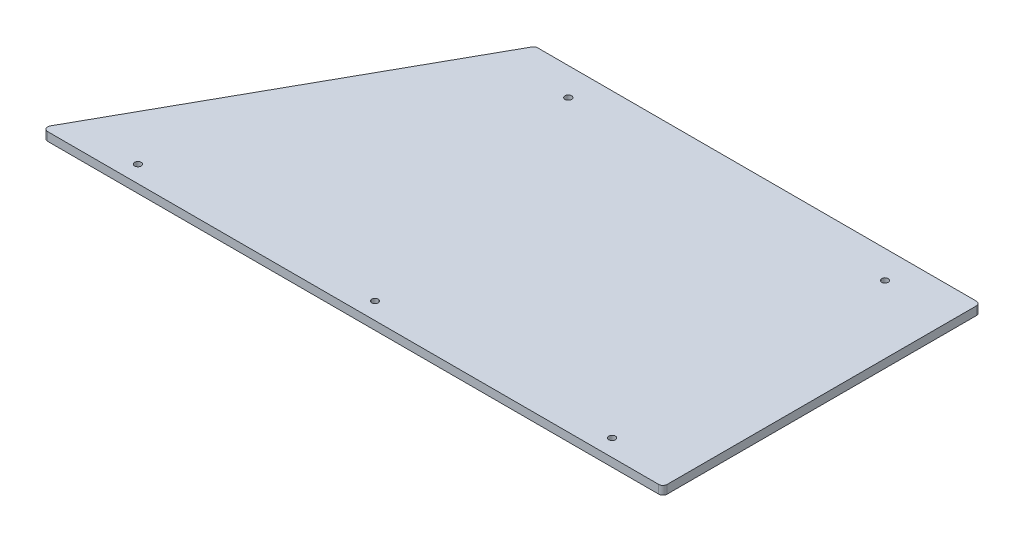
ISO-10303-21;
HEADER;
FILE_DESCRIPTION(('STEP AP214'),'2;1');
FILE_NAME('part.step','',(''),(''),'','','');
FILE_SCHEMA(('AUTOMOTIVE_DESIGN { 1 0 10303 214 1 1 1 1 }'));
ENDSEC;
DATA;
#1=APPLICATION_CONTEXT('core data for automotive mechanical design processes');
#2=APPLICATION_PROTOCOL_DEFINITION('international standard','automotive_design',2000,#1);
#3=PRODUCT_CONTEXT('',#1,'mechanical');
#4=PRODUCT('Part','Part','',(#3));
#5=PRODUCT_RELATED_PRODUCT_CATEGORY('part','',(#4));
#6=PRODUCT_DEFINITION_FORMATION('','',#4);
#7=PRODUCT_DEFINITION_CONTEXT('part definition',#1,'design');
#8=PRODUCT_DEFINITION('design','',#6,#7);
#9=PRODUCT_DEFINITION_SHAPE('','',#8);
#10=(LENGTH_UNIT() NAMED_UNIT(*) SI_UNIT(.MILLI.,.METRE.));
#11=(NAMED_UNIT(*) PLANE_ANGLE_UNIT() SI_UNIT($,.RADIAN.));
#12=(NAMED_UNIT(*) SI_UNIT($,.STERADIAN.) SOLID_ANGLE_UNIT());
#13=UNCERTAINTY_MEASURE_WITH_UNIT(LENGTH_MEASURE(1.E-05),#10,'distance_accuracy_value','');
#14=(GEOMETRIC_REPRESENTATION_CONTEXT(3) GLOBAL_UNCERTAINTY_ASSIGNED_CONTEXT((#13)) GLOBAL_UNIT_ASSIGNED_CONTEXT((#10,
#11,#12)) REPRESENTATION_CONTEXT('',''));
#15=CARTESIAN_POINT('',(0.,0.,0.));
#16=DIRECTION('',(0.,0.,1.));
#17=DIRECTION('',(1.,0.,0.));
#18=AXIS2_PLACEMENT_3D('',#15,#16,#17);
#19=CARTESIAN_POINT('',(0.,6.35,0.));
#20=DIRECTION('',(0.,1.,0.));
#21=DIRECTION('',(0.,0.,1.));
#22=AXIS2_PLACEMENT_3D('',#19,#20,#21);
#23=PLANE('',#22);
#24=CARTESIAN_POINT('',(60.325,6.35,-12.7));
#25=DIRECTION('',(0.,1.,0.));
#26=DIRECTION('',(0.,0.,1.));
#27=AXIS2_PLACEMENT_3D('',#24,#25,#26);
#28=CIRCLE('',#27,2.45745);
#29=CARTESIAN_POINT('',(60.325,6.35,-10.24255));
#30=VERTEX_POINT('',#29);
#31=EDGE_CURVE('E193',#30,#30,#28,.T.);
#32=ORIENTED_EDGE('',*,*,#31,.F.);
#33=EDGE_LOOP('',(#32));
#34=FACE_BOUND('',#33,.T.);
#35=CARTESIAN_POINT('',(415.925,6.35,-12.7));
#36=DIRECTION('',(0.,1.,0.));
#37=DIRECTION('',(0.,0.,1.));
#38=AXIS2_PLACEMENT_3D('',#35,#36,#37);
#39=CIRCLE('',#38,2.45744999999996);
#40=CARTESIAN_POINT('',(415.925,6.35,-10.24255));
#41=VERTEX_POINT('',#40);
#42=EDGE_CURVE('E182',#41,#41,#39,.T.);
#43=ORIENTED_EDGE('',*,*,#42,.F.);
#44=EDGE_LOOP('',(#43));
#45=FACE_BOUND('',#44,.T.);
#46=DIRECTION('',(-0.487097705254162,0.,0.873347482698685));
#47=VECTOR('',#46,1.);
#48=CARTESIAN_POINT('',(0.,6.35,0.));
#49=LINE('',#48,#47);
#50=CARTESIAN_POINT('',(131.902732744387,6.35,-236.496535214182));
#51=VERTEX_POINT('',#50);
#52=CARTESIAN_POINT('',(2.63337218422856,6.35,-4.72153521418196));
#53=VERTEX_POINT('',#52);
#54=EDGE_CURVE('E137',#51,#53,#49,.T.);
#55=ORIENTED_EDGE('',*,*,#54,.T.);
#56=CARTESIAN_POINT('',(5.40625044179688,6.35,-3.175));
#57=DIRECTION('',(0.,1.,0.));
#58=DIRECTION('',(0.,0.,1.));
#59=AXIS2_PLACEMENT_3D('',#56,#57,#58);
#60=CIRCLE('',#59,3.175);
#61=CARTESIAN_POINT('',(5.40625044179688,6.35,0.));
#62=VERTEX_POINT('',#61);
#63=EDGE_CURVE('E156',#53,#62,#60,.T.);
#64=ORIENTED_EDGE('',*,*,#63,.T.);
#65=DIRECTION('',(1.,0.,0.));
#66=VECTOR('',#65,1.);
#67=CARTESIAN_POINT('',(466.725,6.35,0.));
#68=LINE('',#67,#66);
#69=CARTESIAN_POINT('',(463.55,6.35,0.));
#70=VERTEX_POINT('',#69);
#71=EDGE_CURVE('E120',#62,#70,#68,.T.);
#72=ORIENTED_EDGE('',*,*,#71,.T.);
#73=CARTESIAN_POINT('',(463.55,6.35,-3.17500000000001));
#74=DIRECTION('',(0.,1.,0.));
#75=DIRECTION('',(0.,0.,1.));
#76=AXIS2_PLACEMENT_3D('',#73,#74,#75);
#77=CIRCLE('',#76,3.175);
#78=CARTESIAN_POINT('',(466.725,6.35,-3.17500000000001));
#79=VERTEX_POINT('',#78);
#80=EDGE_CURVE('E151',#70,#79,#77,.T.);
#81=ORIENTED_EDGE('',*,*,#80,.T.);
#82=DIRECTION('',(0.,0.,-1.));
#83=VECTOR('',#82,1.);
#84=CARTESIAN_POINT('',(466.725,6.35,-238.125));
#85=LINE('',#84,#83);
#86=CARTESIAN_POINT('',(466.725,6.35,-234.95));
#87=VERTEX_POINT('',#86);
#88=EDGE_CURVE('E167',#79,#87,#85,.T.);
#89=ORIENTED_EDGE('',*,*,#88,.T.);
#90=CARTESIAN_POINT('',(463.55,6.35,-234.95));
#91=DIRECTION('',(0.,1.,0.));
#92=DIRECTION('',(0.,0.,1.));
#93=AXIS2_PLACEMENT_3D('',#90,#91,#92);
#94=CIRCLE('',#93,3.175);
#95=CARTESIAN_POINT('',(463.55,6.35,-238.125));
#96=VERTEX_POINT('',#95);
#97=EDGE_CURVE('E56',#87,#96,#94,.T.);
#98=ORIENTED_EDGE('',*,*,#97,.T.);
#99=DIRECTION('',(-1.,0.,0.));
#100=VECTOR('',#99,1.);
#101=CARTESIAN_POINT('',(132.810986876875,6.35,-238.125));
#102=LINE('',#101,#100);
#103=CARTESIAN_POINT('',(134.675611001956,6.35,-238.125));
#104=VERTEX_POINT('',#103);
#105=EDGE_CURVE('E175',#96,#104,#102,.T.);
#106=ORIENTED_EDGE('',*,*,#105,.T.);
#107=CARTESIAN_POINT('',(134.675611001956,6.35,-234.95));
#108=DIRECTION('',(0.,1.,0.));
#109=DIRECTION('',(0.,0.,1.));
#110=AXIS2_PLACEMENT_3D('',#107,#108,#109);
#111=CIRCLE('',#110,3.175);
#112=EDGE_CURVE('E154',#104,#51,#111,.T.);
#113=ORIENTED_EDGE('',*,*,#112,.T.);
#114=EDGE_LOOP('',(#55,#64,#72,#81,#89,#98,#106,#113));
#115=FACE_BOUND('',#114,.T.);
#116=CARTESIAN_POINT('',(415.925,6.35,-217.297));
#117=DIRECTION('',(0.,1.,0.));
#118=DIRECTION('',(0.,0.,1.));
#119=AXIS2_PLACEMENT_3D('',#116,#117,#118);
#120=CIRCLE('',#119,2.45744999999996);
#121=CARTESIAN_POINT('',(415.925,6.35,-214.83955));
#122=VERTEX_POINT('',#121);
#123=EDGE_CURVE('E128',#122,#122,#120,.T.);
#124=ORIENTED_EDGE('',*,*,#123,.F.);
#125=EDGE_LOOP('',(#124));
#126=FACE_BOUND('',#125,.T.);
#127=CARTESIAN_POINT('',(238.125,6.35,-12.7));
#128=DIRECTION('',(0.,1.,0.));
#129=DIRECTION('',(0.,0.,1.));
#130=AXIS2_PLACEMENT_3D('',#127,#128,#129);
#131=CIRCLE('',#130,2.45745000000002);
#132=CARTESIAN_POINT('',(238.125,6.35,-10.24255));
#133=VERTEX_POINT('',#132);
#134=EDGE_CURVE('E187',#133,#133,#131,.T.);
#135=ORIENTED_EDGE('',*,*,#134,.F.);
#136=EDGE_LOOP('',(#135));
#137=FACE_BOUND('',#136,.T.);
#138=CARTESIAN_POINT('',(178.449400022,6.35,-217.297));
#139=DIRECTION('',(0.,1.,0.));
#140=DIRECTION('',(0.,0.,1.));
#141=AXIS2_PLACEMENT_3D('',#138,#139,#140);
#142=CIRCLE('',#141,2.45744999999992);
#143=CARTESIAN_POINT('',(178.449400022,6.35,-214.83955));
#144=VERTEX_POINT('',#143);
#145=EDGE_CURVE('E199',#144,#144,#142,.T.);
#146=ORIENTED_EDGE('',*,*,#145,.F.);
#147=EDGE_LOOP('',(#146));
#148=FACE_BOUND('',#147,.T.);
#149=ADVANCED_FACE('F34',(#34,#45,#115,#126,#137,#148),#23,.T.);
#150=CARTESIAN_POINT('',(0.,0.,0.));
#151=DIRECTION('',(0.,1.,0.));
#152=DIRECTION('',(0.,0.,1.));
#153=AXIS2_PLACEMENT_3D('',#150,#151,#152);
#154=PLANE('',#153);
#155=DIRECTION('',(1.,0.,0.));
#156=VECTOR('',#155,1.);
#157=CARTESIAN_POINT('',(466.725,0.,0.));
#158=LINE('',#157,#156);
#159=CARTESIAN_POINT('',(5.40625044179688,0.,0.));
#160=VERTEX_POINT('',#159);
#161=CARTESIAN_POINT('',(463.55,0.,0.));
#162=VERTEX_POINT('',#161);
#163=EDGE_CURVE('E117',#160,#162,#158,.T.);
#164=ORIENTED_EDGE('',*,*,#163,.F.);
#165=CARTESIAN_POINT('',(5.40625044179688,0.,-3.175));
#166=DIRECTION('',(0.,1.,0.));
#167=DIRECTION('',(0.,0.,1.));
#168=AXIS2_PLACEMENT_3D('',#165,#166,#167);
#169=CIRCLE('',#168,3.175);
#170=CARTESIAN_POINT('',(2.63337218422856,0.,-4.72153521418196));
#171=VERTEX_POINT('',#170);
#172=EDGE_CURVE('E100',#160,#171,#169,.F.);
#173=ORIENTED_EDGE('',*,*,#172,.T.);
#174=DIRECTION('',(-0.487097705254162,0.,0.873347482698685));
#175=VECTOR('',#174,1.);
#176=CARTESIAN_POINT('',(0.,0.,0.));
#177=LINE('',#176,#175);
#178=CARTESIAN_POINT('',(131.902732744387,0.,-236.496535214182));
#179=VERTEX_POINT('',#178);
#180=EDGE_CURVE('E141',#179,#171,#177,.T.);
#181=ORIENTED_EDGE('',*,*,#180,.F.);
#182=CARTESIAN_POINT('',(134.675611001956,0.,-234.95));
#183=DIRECTION('',(0.,1.,0.));
#184=DIRECTION('',(0.,0.,1.));
#185=AXIS2_PLACEMENT_3D('',#182,#183,#184);
#186=CIRCLE('',#185,3.175);
#187=CARTESIAN_POINT('',(134.675611001956,0.,-238.125));
#188=VERTEX_POINT('',#187);
#189=EDGE_CURVE('E111',#179,#188,#186,.F.);
#190=ORIENTED_EDGE('',*,*,#189,.T.);
#191=DIRECTION('',(-1.,0.,0.));
#192=VECTOR('',#191,1.);
#193=CARTESIAN_POINT('',(132.810986876875,0.,-238.125));
#194=LINE('',#193,#192);
#195=CARTESIAN_POINT('',(463.55,0.,-238.125));
#196=VERTEX_POINT('',#195);
#197=EDGE_CURVE('E131',#196,#188,#194,.T.);
#198=ORIENTED_EDGE('',*,*,#197,.F.);
#199=CARTESIAN_POINT('',(463.55,0.,-234.95));
#200=DIRECTION('',(0.,1.,0.));
#201=DIRECTION('',(0.,0.,1.));
#202=AXIS2_PLACEMENT_3D('',#199,#200,#201);
#203=CIRCLE('',#202,3.175);
#204=CARTESIAN_POINT('',(466.725,0.,-234.95));
#205=VERTEX_POINT('',#204);
#206=EDGE_CURVE('E145',#196,#205,#203,.F.);
#207=ORIENTED_EDGE('',*,*,#206,.T.);
#208=DIRECTION('',(0.,0.,-1.));
#209=VECTOR('',#208,1.);
#210=CARTESIAN_POINT('',(466.725,0.,-238.125));
#211=LINE('',#210,#209);
#212=CARTESIAN_POINT('',(466.725,0.,-3.17500000000001));
#213=VERTEX_POINT('',#212);
#214=EDGE_CURVE('E127',#213,#205,#211,.T.);
#215=ORIENTED_EDGE('',*,*,#214,.F.);
#216=CARTESIAN_POINT('',(463.55,0.,-3.17500000000001));
#217=DIRECTION('',(0.,1.,0.));
#218=DIRECTION('',(0.,0.,1.));
#219=AXIS2_PLACEMENT_3D('',#216,#217,#218);
#220=CIRCLE('',#219,3.175);
#221=EDGE_CURVE('E121',#213,#162,#220,.F.);
#222=ORIENTED_EDGE('',*,*,#221,.T.);
#223=EDGE_LOOP('',(#164,#173,#181,#190,#198,#207,#215,#222));
#224=FACE_BOUND('',#223,.T.);
#225=CARTESIAN_POINT('',(415.925,0.,-217.297));
#226=DIRECTION('',(0.,1.,0.));
#227=DIRECTION('',(0.,0.,1.));
#228=AXIS2_PLACEMENT_3D('',#225,#226,#227);
#229=CIRCLE('',#228,2.45744999999996);
#230=CARTESIAN_POINT('',(415.925,0.,-214.83955));
#231=VERTEX_POINT('',#230);
#232=EDGE_CURVE('E134',#231,#231,#229,.T.);
#233=ORIENTED_EDGE('',*,*,#232,.T.);
#234=EDGE_LOOP('',(#233));
#235=FACE_BOUND('',#234,.T.);
#236=CARTESIAN_POINT('',(415.925,0.,-12.7));
#237=DIRECTION('',(0.,1.,0.));
#238=DIRECTION('',(0.,0.,1.));
#239=AXIS2_PLACEMENT_3D('',#236,#237,#238);
#240=CIRCLE('',#239,2.45744999999996);
#241=CARTESIAN_POINT('',(415.925,0.,-10.24255));
#242=VERTEX_POINT('',#241);
#243=EDGE_CURVE('E184',#242,#242,#240,.T.);
#244=ORIENTED_EDGE('',*,*,#243,.T.);
#245=EDGE_LOOP('',(#244));
#246=FACE_BOUND('',#245,.T.);
#247=CARTESIAN_POINT('',(238.125,0.,-12.7));
#248=DIRECTION('',(0.,1.,0.));
#249=DIRECTION('',(0.,0.,1.));
#250=AXIS2_PLACEMENT_3D('',#247,#248,#249);
#251=CIRCLE('',#250,2.45745000000002);
#252=CARTESIAN_POINT('',(238.125,0.,-10.24255));
#253=VERTEX_POINT('',#252);
#254=EDGE_CURVE('E190',#253,#253,#251,.T.);
#255=ORIENTED_EDGE('',*,*,#254,.T.);
#256=EDGE_LOOP('',(#255));
#257=FACE_BOUND('',#256,.T.);
#258=CARTESIAN_POINT('',(60.325,0.,-12.7));
#259=DIRECTION('',(0.,1.,0.));
#260=DIRECTION('',(0.,0.,1.));
#261=AXIS2_PLACEMENT_3D('',#258,#259,#260);
#262=CIRCLE('',#261,2.45745);
#263=CARTESIAN_POINT('',(60.325,0.,-10.24255));
#264=VERTEX_POINT('',#263);
#265=EDGE_CURVE('E196',#264,#264,#262,.T.);
#266=ORIENTED_EDGE('',*,*,#265,.T.);
#267=EDGE_LOOP('',(#266));
#268=FACE_BOUND('',#267,.T.);
#269=CARTESIAN_POINT('',(178.449400022,0.,-217.297));
#270=DIRECTION('',(0.,1.,0.));
#271=DIRECTION('',(0.,0.,1.));
#272=AXIS2_PLACEMENT_3D('',#269,#270,#271);
#273=CIRCLE('',#272,2.45744999999992);
#274=CARTESIAN_POINT('',(178.449400022,0.,-214.83955));
#275=VERTEX_POINT('',#274);
#276=EDGE_CURVE('E202',#275,#275,#273,.T.);
#277=ORIENTED_EDGE('',*,*,#276,.T.);
#278=EDGE_LOOP('',(#277));
#279=FACE_BOUND('',#278,.T.);
#280=ADVANCED_FACE('F124',(#224,#235,#246,#257,#268,#279),#154,.F.);
#281=CARTESIAN_POINT('',(466.725,6.35,0.));
#282=DIRECTION('',(0.,0.,-1.));
#283=DIRECTION('',(-1.,0.,0.));
#284=AXIS2_PLACEMENT_3D('',#281,#282,#283);
#285=PLANE('',#284);
#286=ORIENTED_EDGE('',*,*,#71,.F.);
#287=DIRECTION('',(0.,-1.,0.));
#288=VECTOR('',#287,1.);
#289=CARTESIAN_POINT('',(5.40625044179688,6.35,0.));
#290=LINE('',#289,#288);
#291=EDGE_CURVE('E104',#62,#160,#290,.T.);
#292=ORIENTED_EDGE('',*,*,#291,.T.);
#293=ORIENTED_EDGE('',*,*,#163,.T.);
#294=DIRECTION('',(0.,-1.,0.));
#295=VECTOR('',#294,1.);
#296=CARTESIAN_POINT('',(463.55,6.35,0.));
#297=LINE('',#296,#295);
#298=EDGE_CURVE('E122',#162,#70,#297,.F.);
#299=ORIENTED_EDGE('',*,*,#298,.T.);
#300=EDGE_LOOP('',(#286,#292,#293,#299));
#301=FACE_BOUND('',#300,.T.);
#302=ADVANCED_FACE('F116',(#301),#285,.F.);
#303=CARTESIAN_POINT('',(466.725,6.35,-238.125));
#304=DIRECTION('',(-1.,0.,0.));
#305=DIRECTION('',(0.,0.,1.));
#306=AXIS2_PLACEMENT_3D('',#303,#304,#305);
#307=PLANE('',#306);
#308=ORIENTED_EDGE('',*,*,#214,.T.);
#309=DIRECTION('',(0.,-1.,0.));
#310=VECTOR('',#309,1.);
#311=CARTESIAN_POINT('',(466.725,6.35,-234.95));
#312=LINE('',#311,#310);
#313=EDGE_CURVE('E11',#205,#87,#312,.F.);
#314=ORIENTED_EDGE('',*,*,#313,.T.);
#315=ORIENTED_EDGE('',*,*,#88,.F.);
#316=DIRECTION('',(0.,-1.,0.));
#317=VECTOR('',#316,1.);
#318=CARTESIAN_POINT('',(466.725,6.35,-3.17500000000001));
#319=LINE('',#318,#317);
#320=EDGE_CURVE('E42',#79,#213,#319,.T.);
#321=ORIENTED_EDGE('',*,*,#320,.T.);
#322=EDGE_LOOP('',(#308,#314,#315,#321));
#323=FACE_BOUND('',#322,.T.);
#324=ADVANCED_FACE('F165',(#323),#307,.F.);
#325=CARTESIAN_POINT('',(132.810986876875,6.35,-238.125));
#326=DIRECTION('',(0.,0.,1.));
#327=DIRECTION('',(1.,0.,0.));
#328=AXIS2_PLACEMENT_3D('',#325,#326,#327);
#329=PLANE('',#328);
#330=ORIENTED_EDGE('',*,*,#197,.T.);
#331=DIRECTION('',(0.,-1.,0.));
#332=VECTOR('',#331,1.);
#333=CARTESIAN_POINT('',(134.675611001956,6.35,-238.125));
#334=LINE('',#333,#332);
#335=EDGE_CURVE('E49',#188,#104,#334,.F.);
#336=ORIENTED_EDGE('',*,*,#335,.T.);
#337=ORIENTED_EDGE('',*,*,#105,.F.);
#338=DIRECTION('',(0.,-1.,0.));
#339=VECTOR('',#338,1.);
#340=CARTESIAN_POINT('',(463.55,6.35,-238.125));
#341=LINE('',#340,#339);
#342=EDGE_CURVE('E158',#96,#196,#341,.T.);
#343=ORIENTED_EDGE('',*,*,#342,.T.);
#344=EDGE_LOOP('',(#330,#336,#337,#343));
#345=FACE_BOUND('',#344,.T.);
#346=ADVANCED_FACE('F174',(#345),#329,.F.);
#347=CARTESIAN_POINT('',(0.,6.35,0.));
#348=DIRECTION('',(0.873347482698685,0.,0.487097705254161));
#349=DIRECTION('',(0.487097705254162,0.,-0.873347482698685));
#350=AXIS2_PLACEMENT_3D('',#347,#348,#349);
#351=PLANE('',#350);
#352=ORIENTED_EDGE('',*,*,#180,.T.);
#353=DIRECTION('',(0.,-1.,0.));
#354=VECTOR('',#353,1.);
#355=CARTESIAN_POINT('',(2.63337218422856,6.35,-4.72153521418196));
#356=LINE('',#355,#354);
#357=EDGE_CURVE('E105',#171,#53,#356,.F.);
#358=ORIENTED_EDGE('',*,*,#357,.T.);
#359=ORIENTED_EDGE('',*,*,#54,.F.);
#360=DIRECTION('',(0.,-1.,0.));
#361=VECTOR('',#360,1.);
#362=CARTESIAN_POINT('',(131.902732744387,6.35,-236.496535214182));
#363=LINE('',#362,#361);
#364=EDGE_CURVE('E110',#51,#179,#363,.T.);
#365=ORIENTED_EDGE('',*,*,#364,.T.);
#366=EDGE_LOOP('',(#352,#358,#359,#365));
#367=FACE_BOUND('',#366,.T.);
#368=ADVANCED_FACE('F224',(#367),#351,.F.);
#369=CARTESIAN_POINT('',(415.925,6.35,-217.297));
#370=DIRECTION('',(0.,-1.,0.));
#371=DIRECTION('',(0.,0.,-1.));
#372=AXIS2_PLACEMENT_3D('',#369,#370,#371);
#373=CYLINDRICAL_SURFACE('',#372,2.45744999999996);
#374=ORIENTED_EDGE('',*,*,#123,.T.);
#375=EDGE_LOOP('',(#374));
#376=FACE_BOUND('',#375,.T.);
#377=ORIENTED_EDGE('',*,*,#232,.F.);
#378=EDGE_LOOP('',(#377));
#379=FACE_BOUND('',#378,.T.);
#380=ADVANCED_FACE('F221',(#376,#379),#373,.F.);
#381=CARTESIAN_POINT('',(415.925,6.35,-12.7));
#382=DIRECTION('',(0.,-1.,0.));
#383=DIRECTION('',(0.,0.,-1.));
#384=AXIS2_PLACEMENT_3D('',#381,#382,#383);
#385=CYLINDRICAL_SURFACE('',#384,2.45744999999996);
#386=ORIENTED_EDGE('',*,*,#42,.T.);
#387=EDGE_LOOP('',(#386));
#388=FACE_BOUND('',#387,.T.);
#389=ORIENTED_EDGE('',*,*,#243,.F.);
#390=EDGE_LOOP('',(#389));
#391=FACE_BOUND('',#390,.T.);
#392=ADVANCED_FACE('F256',(#388,#391),#385,.F.);
#393=CARTESIAN_POINT('',(238.125,6.35,-12.7));
#394=DIRECTION('',(0.,-1.,0.));
#395=DIRECTION('',(0.,0.,-1.));
#396=AXIS2_PLACEMENT_3D('',#393,#394,#395);
#397=CYLINDRICAL_SURFACE('',#396,2.45745000000002);
#398=ORIENTED_EDGE('',*,*,#134,.T.);
#399=EDGE_LOOP('',(#398));
#400=FACE_BOUND('',#399,.T.);
#401=ORIENTED_EDGE('',*,*,#254,.F.);
#402=EDGE_LOOP('',(#401));
#403=FACE_BOUND('',#402,.T.);
#404=ADVANCED_FACE('F252',(#400,#403),#397,.F.);
#405=CARTESIAN_POINT('',(60.325,6.35,-12.7));
#406=DIRECTION('',(0.,-1.,0.));
#407=DIRECTION('',(0.,0.,-1.));
#408=AXIS2_PLACEMENT_3D('',#405,#406,#407);
#409=CYLINDRICAL_SURFACE('',#408,2.45745);
#410=ORIENTED_EDGE('',*,*,#31,.T.);
#411=EDGE_LOOP('',(#410));
#412=FACE_BOUND('',#411,.T.);
#413=ORIENTED_EDGE('',*,*,#265,.F.);
#414=EDGE_LOOP('',(#413));
#415=FACE_BOUND('',#414,.T.);
#416=ADVANCED_FACE('F255',(#412,#415),#409,.F.);
#417=CARTESIAN_POINT('',(178.449400022,6.35,-217.297));
#418=DIRECTION('',(0.,-1.,0.));
#419=DIRECTION('',(0.,0.,-1.));
#420=AXIS2_PLACEMENT_3D('',#417,#418,#419);
#421=CYLINDRICAL_SURFACE('',#420,2.45744999999992);
#422=ORIENTED_EDGE('',*,*,#145,.T.);
#423=EDGE_LOOP('',(#422));
#424=FACE_BOUND('',#423,.T.);
#425=ORIENTED_EDGE('',*,*,#276,.F.);
#426=EDGE_LOOP('',(#425));
#427=FACE_BOUND('',#426,.T.);
#428=ADVANCED_FACE('F208',(#424,#427),#421,.F.);
#429=CARTESIAN_POINT('',(5.40625044179688,6.35,-3.175));
#430=DIRECTION('',(0.,-1.,0.));
#431=DIRECTION('',(0.,0.,-1.));
#432=AXIS2_PLACEMENT_3D('',#429,#430,#431);
#433=CYLINDRICAL_SURFACE('',#432,3.175);
#434=ORIENTED_EDGE('',*,*,#63,.F.);
#435=ORIENTED_EDGE('',*,*,#357,.F.);
#436=ORIENTED_EDGE('',*,*,#172,.F.);
#437=ORIENTED_EDGE('',*,*,#291,.F.);
#438=EDGE_LOOP('',(#434,#435,#436,#437));
#439=FACE_BOUND('',#438,.T.);
#440=ADVANCED_FACE('F103',(#439),#433,.T.);
#441=CARTESIAN_POINT('',(134.675611001956,6.35,-234.95));
#442=DIRECTION('',(0.,-1.,0.));
#443=DIRECTION('',(0.,0.,-1.));
#444=AXIS2_PLACEMENT_3D('',#441,#442,#443);
#445=CYLINDRICAL_SURFACE('',#444,3.175);
#446=ORIENTED_EDGE('',*,*,#112,.F.);
#447=ORIENTED_EDGE('',*,*,#335,.F.);
#448=ORIENTED_EDGE('',*,*,#189,.F.);
#449=ORIENTED_EDGE('',*,*,#364,.F.);
#450=EDGE_LOOP('',(#446,#447,#448,#449));
#451=FACE_BOUND('',#450,.T.);
#452=ADVANCED_FACE('F236',(#451),#445,.T.);
#453=CARTESIAN_POINT('',(463.55,6.35,-234.95));
#454=DIRECTION('',(0.,-1.,0.));
#455=DIRECTION('',(0.,0.,-1.));
#456=AXIS2_PLACEMENT_3D('',#453,#454,#455);
#457=CYLINDRICAL_SURFACE('',#456,3.175);
#458=ORIENTED_EDGE('',*,*,#97,.F.);
#459=ORIENTED_EDGE('',*,*,#313,.F.);
#460=ORIENTED_EDGE('',*,*,#206,.F.);
#461=ORIENTED_EDGE('',*,*,#342,.F.);
#462=EDGE_LOOP('',(#458,#459,#460,#461));
#463=FACE_BOUND('',#462,.T.);
#464=ADVANCED_FACE('F173',(#463),#457,.T.);
#465=CARTESIAN_POINT('',(463.55,6.35,-3.17500000000001));
#466=DIRECTION('',(0.,-1.,0.));
#467=DIRECTION('',(0.,0.,-1.));
#468=AXIS2_PLACEMENT_3D('',#465,#466,#467);
#469=CYLINDRICAL_SURFACE('',#468,3.175);
#470=ORIENTED_EDGE('',*,*,#80,.F.);
#471=ORIENTED_EDGE('',*,*,#298,.F.);
#472=ORIENTED_EDGE('',*,*,#221,.F.);
#473=ORIENTED_EDGE('',*,*,#320,.F.);
#474=EDGE_LOOP('',(#470,#471,#472,#473));
#475=FACE_BOUND('',#474,.T.);
#476=ADVANCED_FACE('F36',(#475),#469,.T.);
#477=CLOSED_SHELL('',(#149,#280,#302,#324,#346,#368,#380,#392,#404,#416,#428,#440,#452,#464,#476));
#478=MANIFOLD_SOLID_BREP('B2',#477);
#479=ADVANCED_BREP_SHAPE_REPRESENTATION('',(#18,#478),#14);
#480=SHAPE_DEFINITION_REPRESENTATION(#9,#479);
ENDSEC;
END-ISO-10303-21;
